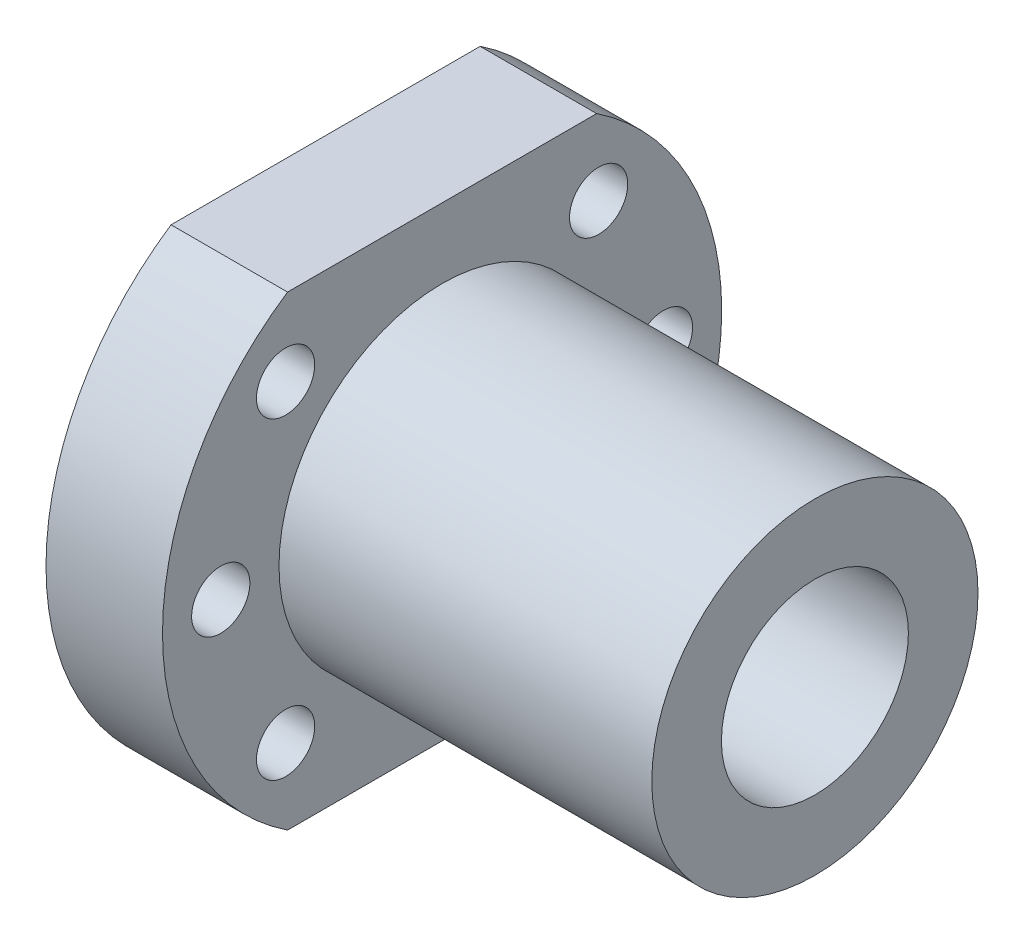
ISO-10303-21;
HEADER;
FILE_DESCRIPTION(('STEP AP214'),'2;1');
FILE_NAME('part.step','',(''),(''),'','','');
FILE_SCHEMA(('AUTOMOTIVE_DESIGN { 1 0 10303 214 1 1 1 1 }'));
ENDSEC;
DATA;
#1=APPLICATION_CONTEXT('core data for automotive mechanical design processes');
#2=APPLICATION_PROTOCOL_DEFINITION('international standard','automotive_design',2000,#1);
#3=PRODUCT_CONTEXT('',#1,'mechanical');
#4=PRODUCT('Part','Part','',(#3));
#5=PRODUCT_RELATED_PRODUCT_CATEGORY('part','',(#4));
#6=PRODUCT_DEFINITION_FORMATION('','',#4);
#7=PRODUCT_DEFINITION_CONTEXT('part definition',#1,'design');
#8=PRODUCT_DEFINITION('design','',#6,#7);
#9=PRODUCT_DEFINITION_SHAPE('','',#8);
#10=(LENGTH_UNIT() NAMED_UNIT(*) SI_UNIT(.MILLI.,.METRE.));
#11=(NAMED_UNIT(*) PLANE_ANGLE_UNIT() SI_UNIT($,.RADIAN.));
#12=(NAMED_UNIT(*) SI_UNIT($,.STERADIAN.) SOLID_ANGLE_UNIT());
#13=UNCERTAINTY_MEASURE_WITH_UNIT(LENGTH_MEASURE(1.E-05),#10,'distance_accuracy_value','');
#14=(GEOMETRIC_REPRESENTATION_CONTEXT(3) GLOBAL_UNCERTAINTY_ASSIGNED_CONTEXT((#13)) GLOBAL_UNIT_ASSIGNED_CONTEXT((#10,
#11,#12)) REPRESENTATION_CONTEXT('',''));
#15=CARTESIAN_POINT('',(0.,0.,0.));
#16=DIRECTION('',(0.,0.,1.));
#17=DIRECTION('',(1.,0.,0.));
#18=AXIS2_PLACEMENT_3D('',#15,#16,#17);
#19=CARTESIAN_POINT('',(0.,0.,0.));
#20=DIRECTION('',(1.,0.,0.));
#21=DIRECTION('',(0.,1.,0.));
#22=AXIS2_PLACEMENT_3D('',#19,#20,#21);
#23=PLANE('',#22);
#24=CARTESIAN_POINT('',(0.,0.,0.));
#25=DIRECTION('',(-1.,0.,0.));
#26=DIRECTION('',(0.,1.,0.));
#27=AXIS2_PLACEMENT_3D('',#24,#25,#26);
#28=CIRCLE('',#27,8.025);
#29=CARTESIAN_POINT('',(0.,-8.025,0.));
#30=VERTEX_POINT('',#29);
#31=EDGE_CURVE('E186',#30,#30,#28,.T.);
#32=ORIENTED_EDGE('',*,*,#31,.F.);
#33=EDGE_LOOP('',(#32));
#34=FACE_BOUND('',#33,.T.);
#35=CARTESIAN_POINT('',(0.,-13.4350288425444,13.4350288425444));
#36=DIRECTION('',(-1.,0.,0.));
#37=DIRECTION('',(0.,1.,0.));
#38=AXIS2_PLACEMENT_3D('',#35,#36,#37);
#39=CIRCLE('',#38,2.5);
#40=CARTESIAN_POINT('',(0.,-15.9350288425444,13.4350288425444));
#41=VERTEX_POINT('',#40);
#42=EDGE_CURVE('E199',#41,#41,#39,.T.);
#43=ORIENTED_EDGE('',*,*,#42,.F.);
#44=EDGE_LOOP('',(#43));
#45=FACE_BOUND('',#44,.T.);
#46=CARTESIAN_POINT('',(0.,13.4350288425444,13.4350288425444));
#47=DIRECTION('',(-1.,0.,0.));
#48=DIRECTION('',(0.,1.,0.));
#49=AXIS2_PLACEMENT_3D('',#46,#47,#48);
#50=CIRCLE('',#49,2.5);
#51=CARTESIAN_POINT('',(0.,10.9350288425444,13.4350288425444));
#52=VERTEX_POINT('',#51);
#53=EDGE_CURVE('E188',#52,#52,#50,.T.);
#54=ORIENTED_EDGE('',*,*,#53,.F.);
#55=EDGE_LOOP('',(#54));
#56=FACE_BOUND('',#55,.T.);
#57=CARTESIAN_POINT('',(0.,13.4350288425444,-13.4350288425444));
#58=DIRECTION('',(-1.,0.,0.));
#59=DIRECTION('',(0.,1.,0.));
#60=AXIS2_PLACEMENT_3D('',#57,#58,#59);
#61=CIRCLE('',#60,2.5);
#62=CARTESIAN_POINT('',(0.,10.9350288425444,-13.4350288425444));
#63=VERTEX_POINT('',#62);
#64=EDGE_CURVE('E229',#63,#63,#61,.T.);
#65=ORIENTED_EDGE('',*,*,#64,.F.);
#66=EDGE_LOOP('',(#65));
#67=FACE_BOUND('',#66,.T.);
#68=CARTESIAN_POINT('',(0.,0.,19.0000002831221));
#69=DIRECTION('',(-1.,0.,0.));
#70=DIRECTION('',(0.,1.,0.));
#71=AXIS2_PLACEMENT_3D('',#68,#69,#70);
#72=CIRCLE('',#71,2.5);
#73=CARTESIAN_POINT('',(0.,-2.5,19.0000002831221));
#74=VERTEX_POINT('',#73);
#75=EDGE_CURVE('E177',#74,#74,#72,.T.);
#76=ORIENTED_EDGE('',*,*,#75,.F.);
#77=EDGE_LOOP('',(#76));
#78=FACE_BOUND('',#77,.T.);
#79=CARTESIAN_POINT('',(0.,0.,-19.0000002831221));
#80=DIRECTION('',(-1.,0.,0.));
#81=DIRECTION('',(0.,1.,0.));
#82=AXIS2_PLACEMENT_3D('',#79,#80,#81);
#83=CIRCLE('',#82,2.5);
#84=CARTESIAN_POINT('',(0.,-2.5,-19.0000002831221));
#85=VERTEX_POINT('',#84);
#86=EDGE_CURVE('E114',#85,#85,#83,.T.);
#87=ORIENTED_EDGE('',*,*,#86,.F.);
#88=EDGE_LOOP('',(#87));
#89=FACE_BOUND('',#88,.T.);
#90=CARTESIAN_POINT('',(0.,-13.4350288425444,-13.4350288425444));
#91=DIRECTION('',(-1.,0.,0.));
#92=DIRECTION('',(0.,1.,0.));
#93=AXIS2_PLACEMENT_3D('',#90,#91,#92);
#94=CIRCLE('',#93,2.5);
#95=CARTESIAN_POINT('',(0.,-15.9350288425444,-13.4350288425444));
#96=VERTEX_POINT('',#95);
#97=EDGE_CURVE('E168',#96,#96,#94,.T.);
#98=ORIENTED_EDGE('',*,*,#97,.F.);
#99=EDGE_LOOP('',(#98));
#100=FACE_BOUND('',#99,.T.);
#101=CARTESIAN_POINT('',(0.,0.,0.));
#102=DIRECTION('',(1.,0.,0.));
#103=DIRECTION('',(0.,1.,0.));
#104=AXIS2_PLACEMENT_3D('',#101,#102,#103);
#105=CIRCLE('',#104,24.);
#106=CARTESIAN_POINT('',(0.,-20.,-13.2664991614216));
#107=VERTEX_POINT('',#106);
#108=CARTESIAN_POINT('',(0.,20.,-13.2664991614216));
#109=VERTEX_POINT('',#108);
#110=EDGE_CURVE('E26',#107,#109,#105,.T.);
#111=ORIENTED_EDGE('',*,*,#110,.F.);
#112=DIRECTION('',(0.,0.,1.));
#113=VECTOR('',#112,1.);
#114=CARTESIAN_POINT('',(0.,-20.,-35.));
#115=LINE('',#114,#113);
#116=CARTESIAN_POINT('',(0.,-20.,13.2664991614216));
#117=VERTEX_POINT('',#116);
#118=EDGE_CURVE('E149',#107,#117,#115,.T.);
#119=ORIENTED_EDGE('',*,*,#118,.T.);
#120=CARTESIAN_POINT('',(0.,0.,0.));
#121=DIRECTION('',(1.,0.,0.));
#122=DIRECTION('',(0.,1.,0.));
#123=AXIS2_PLACEMENT_3D('',#120,#121,#122);
#124=CIRCLE('',#123,24.);
#125=CARTESIAN_POINT('',(0.,20.,13.2664991614216));
#126=VERTEX_POINT('',#125);
#127=EDGE_CURVE('E139',#126,#117,#124,.T.);
#128=ORIENTED_EDGE('',*,*,#127,.F.);
#129=DIRECTION('',(0.,0.,-1.));
#130=VECTOR('',#129,1.);
#131=CARTESIAN_POINT('',(0.,20.,35.));
#132=LINE('',#131,#130);
#133=EDGE_CURVE('E151',#126,#109,#132,.T.);
#134=ORIENTED_EDGE('',*,*,#133,.T.);
#135=EDGE_LOOP('',(#111,#119,#128,#134));
#136=FACE_BOUND('',#135,.T.);
#137=ADVANCED_FACE('F15',(#34,#45,#56,#67,#78,#89,#100,#136),#23,.F.);
#138=CARTESIAN_POINT('',(10.,0.,0.));
#139=DIRECTION('',(1.,0.,0.));
#140=DIRECTION('',(0.,1.,0.));
#141=AXIS2_PLACEMENT_3D('',#138,#139,#140);
#142=PLANE('',#141);
#143=CARTESIAN_POINT('',(10.,-13.4350288425444,13.4350288425444));
#144=DIRECTION('',(-1.,0.,0.));
#145=DIRECTION('',(0.,1.,0.));
#146=AXIS2_PLACEMENT_3D('',#143,#144,#145);
#147=CIRCLE('',#146,2.5);
#148=CARTESIAN_POINT('',(10.,-15.9350288425444,13.4350288425444));
#149=VERTEX_POINT('',#148);
#150=EDGE_CURVE('E200',#149,#149,#147,.T.);
#151=ORIENTED_EDGE('',*,*,#150,.T.);
#152=EDGE_LOOP('',(#151));
#153=FACE_BOUND('',#152,.T.);
#154=CARTESIAN_POINT('',(10.,13.4350288425444,13.4350288425444));
#155=DIRECTION('',(-1.,0.,0.));
#156=DIRECTION('',(0.,1.,0.));
#157=AXIS2_PLACEMENT_3D('',#154,#155,#156);
#158=CIRCLE('',#157,2.5);
#159=CARTESIAN_POINT('',(10.,10.9350288425444,13.4350288425444));
#160=VERTEX_POINT('',#159);
#161=EDGE_CURVE('E211',#160,#160,#158,.T.);
#162=ORIENTED_EDGE('',*,*,#161,.T.);
#163=EDGE_LOOP('',(#162));
#164=FACE_BOUND('',#163,.T.);
#165=CARTESIAN_POINT('',(10.,13.4350288425444,-13.4350288425444));
#166=DIRECTION('',(-1.,0.,0.));
#167=DIRECTION('',(0.,1.,0.));
#168=AXIS2_PLACEMENT_3D('',#165,#166,#167);
#169=CIRCLE('',#168,2.5);
#170=CARTESIAN_POINT('',(10.,10.9350288425444,-13.4350288425444));
#171=VERTEX_POINT('',#170);
#172=EDGE_CURVE('E191',#171,#171,#169,.T.);
#173=ORIENTED_EDGE('',*,*,#172,.T.);
#174=EDGE_LOOP('',(#173));
#175=FACE_BOUND('',#174,.T.);
#176=CARTESIAN_POINT('',(10.,0.,19.0000002831221));
#177=DIRECTION('',(-1.,0.,0.));
#178=DIRECTION('',(0.,1.,0.));
#179=AXIS2_PLACEMENT_3D('',#176,#177,#178);
#180=CIRCLE('',#179,2.5);
#181=CARTESIAN_POINT('',(10.,-2.5,19.0000002831221));
#182=VERTEX_POINT('',#181);
#183=EDGE_CURVE('E232',#182,#182,#180,.T.);
#184=ORIENTED_EDGE('',*,*,#183,.T.);
#185=EDGE_LOOP('',(#184));
#186=FACE_BOUND('',#185,.T.);
#187=CARTESIAN_POINT('',(10.,0.,-19.0000002831221));
#188=DIRECTION('',(-1.,0.,0.));
#189=DIRECTION('',(0.,1.,0.));
#190=AXIS2_PLACEMENT_3D('',#187,#188,#189);
#191=CIRCLE('',#190,2.5);
#192=CARTESIAN_POINT('',(10.,-2.5,-19.0000002831221));
#193=VERTEX_POINT('',#192);
#194=EDGE_CURVE('E19',#193,#193,#191,.T.);
#195=ORIENTED_EDGE('',*,*,#194,.T.);
#196=EDGE_LOOP('',(#195));
#197=FACE_BOUND('',#196,.T.);
#198=CARTESIAN_POINT('',(10.,-13.4350288425444,-13.4350288425444));
#199=DIRECTION('',(-1.,0.,0.));
#200=DIRECTION('',(0.,1.,0.));
#201=AXIS2_PLACEMENT_3D('',#198,#199,#200);
#202=CIRCLE('',#201,2.5);
#203=CARTESIAN_POINT('',(10.,-15.9350288425444,-13.4350288425444));
#204=VERTEX_POINT('',#203);
#205=EDGE_CURVE('E201',#204,#204,#202,.T.);
#206=ORIENTED_EDGE('',*,*,#205,.T.);
#207=EDGE_LOOP('',(#206));
#208=FACE_BOUND('',#207,.T.);
#209=CARTESIAN_POINT('',(10.,0.,0.));
#210=DIRECTION('',(-1.,0.,0.));
#211=DIRECTION('',(0.,1.,0.));
#212=AXIS2_PLACEMENT_3D('',#209,#210,#211);
#213=CIRCLE('',#212,14.);
#214=CARTESIAN_POINT('',(10.,-14.,0.));
#215=VERTEX_POINT('',#214);
#216=EDGE_CURVE('E245',#215,#215,#213,.T.);
#217=ORIENTED_EDGE('',*,*,#216,.T.);
#218=EDGE_LOOP('',(#217));
#219=FACE_BOUND('',#218,.T.);
#220=CARTESIAN_POINT('',(10.,0.,0.));
#221=DIRECTION('',(1.,0.,0.));
#222=DIRECTION('',(0.,1.,0.));
#223=AXIS2_PLACEMENT_3D('',#220,#221,#222);
#224=CIRCLE('',#223,24.);
#225=CARTESIAN_POINT('',(10.,-20.,-13.2664991614216));
#226=VERTEX_POINT('',#225);
#227=CARTESIAN_POINT('',(10.,20.,-13.2664991614216));
#228=VERTEX_POINT('',#227);
#229=EDGE_CURVE('E10',#226,#228,#224,.T.);
#230=ORIENTED_EDGE('',*,*,#229,.T.);
#231=DIRECTION('',(0.,0.,1.));
#232=VECTOR('',#231,1.);
#233=CARTESIAN_POINT('',(10.,20.,35.));
#234=LINE('',#233,#232);
#235=CARTESIAN_POINT('',(10.,20.,13.2664991614216));
#236=VERTEX_POINT('',#235);
#237=EDGE_CURVE('E217',#228,#236,#234,.T.);
#238=ORIENTED_EDGE('',*,*,#237,.T.);
#239=CARTESIAN_POINT('',(10.,0.,0.));
#240=DIRECTION('',(1.,0.,0.));
#241=DIRECTION('',(0.,1.,0.));
#242=AXIS2_PLACEMENT_3D('',#239,#240,#241);
#243=CIRCLE('',#242,24.);
#244=CARTESIAN_POINT('',(10.,-20.,13.2664991614216));
#245=VERTEX_POINT('',#244);
#246=EDGE_CURVE('E208',#236,#245,#243,.T.);
#247=ORIENTED_EDGE('',*,*,#246,.T.);
#248=DIRECTION('',(0.,0.,-1.));
#249=VECTOR('',#248,1.);
#250=CARTESIAN_POINT('',(10.,-20.,-35.));
#251=LINE('',#250,#249);
#252=EDGE_CURVE('E163',#245,#226,#251,.T.);
#253=ORIENTED_EDGE('',*,*,#252,.T.);
#254=EDGE_LOOP('',(#230,#238,#247,#253));
#255=FACE_BOUND('',#254,.T.);
#256=ADVANCED_FACE('F361',(#153,#164,#175,#186,#197,#208,#219,#255),#142,.T.);
#257=CARTESIAN_POINT('',(0.,0.,0.));
#258=DIRECTION('',(1.,0.,0.));
#259=DIRECTION('',(0.,1.,0.));
#260=AXIS2_PLACEMENT_3D('',#257,#258,#259);
#261=CYLINDRICAL_SURFACE('',#260,24.);
#262=ORIENTED_EDGE('',*,*,#110,.T.);
#263=DIRECTION('',(1.,0.,0.));
#264=VECTOR('',#263,1.);
#265=CARTESIAN_POINT('',(0.,20.,-13.2664991614216));
#266=LINE('',#265,#264);
#267=EDGE_CURVE('E155',#109,#228,#266,.T.);
#268=ORIENTED_EDGE('',*,*,#267,.T.);
#269=ORIENTED_EDGE('',*,*,#229,.F.);
#270=DIRECTION('',(1.,0.,0.));
#271=VECTOR('',#270,1.);
#272=CARTESIAN_POINT('',(0.,-20.,-13.2664991614216));
#273=LINE('',#272,#271);
#274=EDGE_CURVE('E158',#107,#226,#273,.T.);
#275=ORIENTED_EDGE('',*,*,#274,.F.);
#276=EDGE_LOOP('',(#262,#268,#269,#275));
#277=FACE_BOUND('',#276,.T.);
#278=ADVANCED_FACE('F159',(#277),#261,.T.);
#279=CARTESIAN_POINT('',(0.,20.,-13.2664991614216));
#280=DIRECTION('',(0.,1.,0.));
#281=DIRECTION('',(1.,0.,0.));
#282=AXIS2_PLACEMENT_3D('',#279,#280,#281);
#283=PLANE('',#282);
#284=ORIENTED_EDGE('',*,*,#133,.F.);
#285=DIRECTION('',(1.,0.,0.));
#286=VECTOR('',#285,1.);
#287=CARTESIAN_POINT('',(0.,20.,13.2664991614216));
#288=LINE('',#287,#286);
#289=EDGE_CURVE('E204',#126,#236,#288,.T.);
#290=ORIENTED_EDGE('',*,*,#289,.T.);
#291=ORIENTED_EDGE('',*,*,#237,.F.);
#292=ORIENTED_EDGE('',*,*,#267,.F.);
#293=EDGE_LOOP('',(#284,#290,#291,#292));
#294=FACE_BOUND('',#293,.T.);
#295=ADVANCED_FACE('F360',(#294),#283,.T.);
#296=CARTESIAN_POINT('',(0.,0.,0.));
#297=DIRECTION('',(1.,0.,0.));
#298=DIRECTION('',(0.,1.,0.));
#299=AXIS2_PLACEMENT_3D('',#296,#297,#298);
#300=CYLINDRICAL_SURFACE('',#299,24.);
#301=ORIENTED_EDGE('',*,*,#127,.T.);
#302=DIRECTION('',(1.,0.,0.));
#303=VECTOR('',#302,1.);
#304=CARTESIAN_POINT('',(0.,-20.,13.2664991614216));
#305=LINE('',#304,#303);
#306=EDGE_CURVE('E166',#117,#245,#305,.T.);
#307=ORIENTED_EDGE('',*,*,#306,.T.);
#308=ORIENTED_EDGE('',*,*,#246,.F.);
#309=ORIENTED_EDGE('',*,*,#289,.F.);
#310=EDGE_LOOP('',(#301,#307,#308,#309));
#311=FACE_BOUND('',#310,.T.);
#312=ADVANCED_FACE('F380',(#311),#300,.T.);
#313=CARTESIAN_POINT('',(0.,-20.,13.2664991614216));
#314=DIRECTION('',(0.,-1.,0.));
#315=DIRECTION('',(0.,0.,-1.));
#316=AXIS2_PLACEMENT_3D('',#313,#314,#315);
#317=PLANE('',#316);
#318=ORIENTED_EDGE('',*,*,#118,.F.);
#319=ORIENTED_EDGE('',*,*,#274,.T.);
#320=ORIENTED_EDGE('',*,*,#252,.F.);
#321=ORIENTED_EDGE('',*,*,#306,.F.);
#322=EDGE_LOOP('',(#318,#319,#320,#321));
#323=FACE_BOUND('',#322,.T.);
#324=ADVANCED_FACE('F165',(#323),#317,.T.);
#325=CARTESIAN_POINT('',(0.,-13.4350288425444,-13.4350288425444));
#326=DIRECTION('',(1.,0.,0.));
#327=DIRECTION('',(0.,1.,0.));
#328=AXIS2_PLACEMENT_3D('',#325,#326,#327);
#329=CYLINDRICAL_SURFACE('',#328,2.5);
#330=ORIENTED_EDGE('',*,*,#205,.F.);
#331=DIRECTION('',(-1.,0.,0.));
#332=VECTOR('',#331,1.);
#333=CARTESIAN_POINT('',(0.,-15.9350288425444,-13.4350288425444));
#334=LINE('',#333,#332);
#335=EDGE_CURVE('E105',#204,#96,#334,.T.);
#336=ORIENTED_EDGE('',*,*,#335,.T.);
#337=ORIENTED_EDGE('',*,*,#97,.T.);
#338=ORIENTED_EDGE('',*,*,#335,.F.);
#339=EDGE_LOOP('',(#330,#336,#337,#338));
#340=FACE_BOUND('',#339,.T.);
#341=ADVANCED_FACE('F412',(#340),#329,.F.);
#342=CARTESIAN_POINT('',(0.,0.,-19.0000002831221));
#343=DIRECTION('',(1.,0.,0.));
#344=DIRECTION('',(0.,1.,0.));
#345=AXIS2_PLACEMENT_3D('',#342,#343,#344);
#346=CYLINDRICAL_SURFACE('',#345,2.5);
#347=ORIENTED_EDGE('',*,*,#194,.F.);
#348=DIRECTION('',(-1.,0.,0.));
#349=VECTOR('',#348,1.);
#350=CARTESIAN_POINT('',(0.,-2.5,-19.0000002831221));
#351=LINE('',#350,#349);
#352=EDGE_CURVE('E179',#193,#85,#351,.T.);
#353=ORIENTED_EDGE('',*,*,#352,.T.);
#354=ORIENTED_EDGE('',*,*,#86,.T.);
#355=ORIENTED_EDGE('',*,*,#352,.F.);
#356=EDGE_LOOP('',(#347,#353,#354,#355));
#357=FACE_BOUND('',#356,.T.);
#358=ADVANCED_FACE('F417',(#357),#346,.F.);
#359=CARTESIAN_POINT('',(0.,0.,19.0000002831221));
#360=DIRECTION('',(1.,0.,0.));
#361=DIRECTION('',(0.,1.,0.));
#362=AXIS2_PLACEMENT_3D('',#359,#360,#361);
#363=CYLINDRICAL_SURFACE('',#362,2.5);
#364=ORIENTED_EDGE('',*,*,#183,.F.);
#365=DIRECTION('',(-1.,0.,0.));
#366=VECTOR('',#365,1.);
#367=CARTESIAN_POINT('',(0.,-2.5,19.0000002831221));
#368=LINE('',#367,#366);
#369=EDGE_CURVE('E236',#182,#74,#368,.T.);
#370=ORIENTED_EDGE('',*,*,#369,.T.);
#371=ORIENTED_EDGE('',*,*,#75,.T.);
#372=ORIENTED_EDGE('',*,*,#369,.F.);
#373=EDGE_LOOP('',(#364,#370,#371,#372));
#374=FACE_BOUND('',#373,.T.);
#375=ADVANCED_FACE('F373',(#374),#363,.F.);
#376=CARTESIAN_POINT('',(0.,13.4350288425444,-13.4350288425444));
#377=DIRECTION('',(1.,0.,0.));
#378=DIRECTION('',(0.,1.,0.));
#379=AXIS2_PLACEMENT_3D('',#376,#377,#378);
#380=CYLINDRICAL_SURFACE('',#379,2.5);
#381=ORIENTED_EDGE('',*,*,#172,.F.);
#382=DIRECTION('',(-1.,0.,0.));
#383=VECTOR('',#382,1.);
#384=CARTESIAN_POINT('',(0.,10.9350288425444,-13.4350288425444));
#385=LINE('',#384,#383);
#386=EDGE_CURVE('E225',#171,#63,#385,.T.);
#387=ORIENTED_EDGE('',*,*,#386,.T.);
#388=ORIENTED_EDGE('',*,*,#64,.T.);
#389=ORIENTED_EDGE('',*,*,#386,.F.);
#390=EDGE_LOOP('',(#381,#387,#388,#389));
#391=FACE_BOUND('',#390,.T.);
#392=ADVANCED_FACE('F367',(#391),#380,.F.);
#393=CARTESIAN_POINT('',(0.,13.4350288425444,13.4350288425444));
#394=DIRECTION('',(1.,0.,0.));
#395=DIRECTION('',(0.,1.,0.));
#396=AXIS2_PLACEMENT_3D('',#393,#394,#395);
#397=CYLINDRICAL_SURFACE('',#396,2.5);
#398=ORIENTED_EDGE('',*,*,#161,.F.);
#399=DIRECTION('',(-1.,0.,0.));
#400=VECTOR('',#399,1.);
#401=CARTESIAN_POINT('',(0.,10.9350288425444,13.4350288425444));
#402=LINE('',#401,#400);
#403=EDGE_CURVE('E192',#160,#52,#402,.T.);
#404=ORIENTED_EDGE('',*,*,#403,.T.);
#405=ORIENTED_EDGE('',*,*,#53,.T.);
#406=ORIENTED_EDGE('',*,*,#403,.F.);
#407=EDGE_LOOP('',(#398,#404,#405,#406));
#408=FACE_BOUND('',#407,.T.);
#409=ADVANCED_FACE('F372',(#408),#397,.F.);
#410=CARTESIAN_POINT('',(0.,-13.4350288425444,13.4350288425444));
#411=DIRECTION('',(1.,0.,0.));
#412=DIRECTION('',(0.,1.,0.));
#413=AXIS2_PLACEMENT_3D('',#410,#411,#412);
#414=CYLINDRICAL_SURFACE('',#413,2.5);
#415=ORIENTED_EDGE('',*,*,#150,.F.);
#416=DIRECTION('',(-1.,0.,0.));
#417=VECTOR('',#416,1.);
#418=CARTESIAN_POINT('',(0.,-15.9350288425444,13.4350288425444));
#419=LINE('',#418,#417);
#420=EDGE_CURVE('E195',#149,#41,#419,.T.);
#421=ORIENTED_EDGE('',*,*,#420,.T.);
#422=ORIENTED_EDGE('',*,*,#42,.T.);
#423=ORIENTED_EDGE('',*,*,#420,.F.);
#424=EDGE_LOOP('',(#415,#421,#422,#423));
#425=FACE_BOUND('',#424,.T.);
#426=ADVANCED_FACE('F17',(#425),#414,.F.);
#427=CARTESIAN_POINT('',(0.,0.,0.));
#428=DIRECTION('',(1.,0.,0.));
#429=DIRECTION('',(0.,1.,0.));
#430=AXIS2_PLACEMENT_3D('',#427,#428,#429);
#431=CYLINDRICAL_SURFACE('',#430,8.025);
#432=CARTESIAN_POINT('',(42.,0.,0.));
#433=DIRECTION('',(-1.,0.,0.));
#434=DIRECTION('',(0.,1.,0.));
#435=AXIS2_PLACEMENT_3D('',#432,#433,#434);
#436=CIRCLE('',#435,8.025);
#437=CARTESIAN_POINT('',(42.,-8.025,0.));
#438=VERTEX_POINT('',#437);
#439=EDGE_CURVE('E187',#438,#438,#436,.T.);
#440=ORIENTED_EDGE('',*,*,#439,.F.);
#441=DIRECTION('',(-1.,0.,0.));
#442=VECTOR('',#441,1.);
#443=CARTESIAN_POINT('',(0.,-8.025,0.));
#444=LINE('',#443,#442);
#445=EDGE_CURVE('E182',#438,#30,#444,.T.);
#446=ORIENTED_EDGE('',*,*,#445,.T.);
#447=ORIENTED_EDGE('',*,*,#31,.T.);
#448=ORIENTED_EDGE('',*,*,#445,.F.);
#449=EDGE_LOOP('',(#440,#446,#447,#448));
#450=FACE_BOUND('',#449,.T.);
#451=ADVANCED_FACE('F269',(#450),#431,.F.);
#452=CARTESIAN_POINT('',(42.,0.,0.));
#453=DIRECTION('',(1.,0.,0.));
#454=DIRECTION('',(0.,1.,0.));
#455=AXIS2_PLACEMENT_3D('',#452,#453,#454);
#456=PLANE('',#455);
#457=ORIENTED_EDGE('',*,*,#439,.T.);
#458=EDGE_LOOP('',(#457));
#459=FACE_BOUND('',#458,.T.);
#460=CARTESIAN_POINT('',(42.,0.,0.));
#461=DIRECTION('',(1.,0.,0.));
#462=DIRECTION('',(0.,1.,0.));
#463=AXIS2_PLACEMENT_3D('',#460,#461,#462);
#464=CIRCLE('',#463,14.);
#465=CARTESIAN_POINT('',(42.,-14.,0.));
#466=VERTEX_POINT('',#465);
#467=EDGE_CURVE('E212',#466,#466,#464,.T.);
#468=ORIENTED_EDGE('',*,*,#467,.T.);
#469=EDGE_LOOP('',(#468));
#470=FACE_BOUND('',#469,.T.);
#471=ADVANCED_FACE('F266',(#459,#470),#456,.T.);
#472=CARTESIAN_POINT('',(10.,0.,0.));
#473=DIRECTION('',(1.,0.,0.));
#474=DIRECTION('',(0.,1.,0.));
#475=AXIS2_PLACEMENT_3D('',#472,#473,#474);
#476=CYLINDRICAL_SURFACE('',#475,14.);
#477=ORIENTED_EDGE('',*,*,#467,.F.);
#478=DIRECTION('',(-1.,0.,0.));
#479=VECTOR('',#478,1.);
#480=CARTESIAN_POINT('',(10.,-14.,0.));
#481=LINE('',#480,#479);
#482=EDGE_CURVE('E216',#466,#215,#481,.T.);
#483=ORIENTED_EDGE('',*,*,#482,.T.);
#484=ORIENTED_EDGE('',*,*,#216,.F.);
#485=ORIENTED_EDGE('',*,*,#482,.F.);
#486=EDGE_LOOP('',(#477,#483,#484,#485));
#487=FACE_BOUND('',#486,.T.);
#488=ADVANCED_FACE('F347',(#487),#476,.T.);
#489=CLOSED_SHELL('',(#137,#256,#278,#295,#312,#324,#341,#358,#375,#392,#409,#426,#451,#471,#488));
#490=MANIFOLD_SOLID_BREP('B1',#489);
#491=ADVANCED_BREP_SHAPE_REPRESENTATION('',(#18,#490),#14);
#492=SHAPE_DEFINITION_REPRESENTATION(#9,#491);
ENDSEC;
END-ISO-10303-21;
